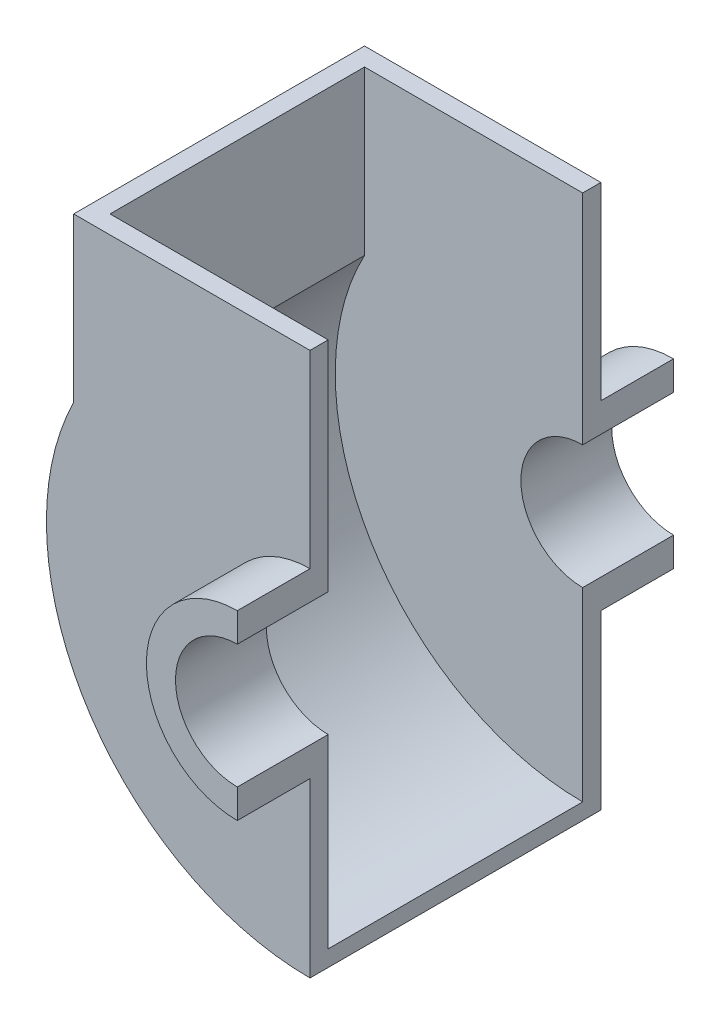
ISO-10303-21;
HEADER;
FILE_DESCRIPTION(('STEP AP214'),'2;1');
FILE_NAME('part.step','',(''),(''),'','','');
FILE_SCHEMA(('AUTOMOTIVE_DESIGN { 1 0 10303 214 1 1 1 1 }'));
ENDSEC;
DATA;
#1=APPLICATION_CONTEXT('core data for automotive mechanical design processes');
#2=APPLICATION_PROTOCOL_DEFINITION('international standard','automotive_design',2000,#1);
#3=PRODUCT_CONTEXT('',#1,'mechanical');
#4=PRODUCT('Part','Part','',(#3));
#5=PRODUCT_RELATED_PRODUCT_CATEGORY('part','',(#4));
#6=PRODUCT_DEFINITION_FORMATION('','',#4);
#7=PRODUCT_DEFINITION_CONTEXT('part definition',#1,'design');
#8=PRODUCT_DEFINITION('design','',#6,#7);
#9=PRODUCT_DEFINITION_SHAPE('','',#8);
#10=(LENGTH_UNIT() NAMED_UNIT(*) SI_UNIT(.MILLI.,.METRE.));
#11=(NAMED_UNIT(*) PLANE_ANGLE_UNIT() SI_UNIT($,.RADIAN.));
#12=(NAMED_UNIT(*) SI_UNIT($,.STERADIAN.) SOLID_ANGLE_UNIT());
#13=UNCERTAINTY_MEASURE_WITH_UNIT(LENGTH_MEASURE(1.E-05),#10,'distance_accuracy_value','');
#14=(GEOMETRIC_REPRESENTATION_CONTEXT(3) GLOBAL_UNCERTAINTY_ASSIGNED_CONTEXT((#13)) GLOBAL_UNIT_ASSIGNED_CONTEXT((#10,
#11,#12)) REPRESENTATION_CONTEXT('',''));
#15=CARTESIAN_POINT('',(0.,0.,0.));
#16=DIRECTION('',(0.,0.,1.));
#17=DIRECTION('',(1.,0.,0.));
#18=AXIS2_PLACEMENT_3D('',#15,#16,#17);
#19=CARTESIAN_POINT('',(0.,0.,-5.));
#20=DIRECTION('',(0.,0.,1.));
#21=DIRECTION('',(1.,0.,0.));
#22=AXIS2_PLACEMENT_3D('',#19,#20,#21);
#23=CYLINDRICAL_SURFACE('',#22,17.);
#24=DIRECTION('',(0.,0.,1.));
#25=VECTOR('',#24,1.);
#26=CARTESIAN_POINT('',(0.,17.,-5.));
#27=LINE('',#26,#25);
#28=CARTESIAN_POINT('',(0.,17.,-5.));
#29=VERTEX_POINT('',#28);
#30=CARTESIAN_POINT('',(0.,17.,20.));
#31=VERTEX_POINT('',#30);
#32=EDGE_CURVE('E46',#29,#31,#27,.T.);
#33=ORIENTED_EDGE('',*,*,#32,.T.);
#34=CARTESIAN_POINT('',(0.,0.,20.));
#35=DIRECTION('',(0.,0.,-1.));
#36=DIRECTION('',(1.,0.,0.));
#37=AXIS2_PLACEMENT_3D('',#34,#35,#36);
#38=CIRCLE('',#37,17.);
#39=CARTESIAN_POINT('',(0.,-17.,20.));
#40=VERTEX_POINT('',#39);
#41=EDGE_CURVE('E263',#40,#31,#38,.T.);
#42=ORIENTED_EDGE('',*,*,#41,.F.);
#43=DIRECTION('',(0.,0.,1.));
#44=VECTOR('',#43,1.);
#45=CARTESIAN_POINT('',(0.,-17.,-5.));
#46=LINE('',#45,#44);
#47=CARTESIAN_POINT('',(0.,-17.,-5.));
#48=VERTEX_POINT('',#47);
#49=EDGE_CURVE('E11',#48,#40,#46,.T.);
#50=ORIENTED_EDGE('',*,*,#49,.F.);
#51=CARTESIAN_POINT('',(0.,0.,-5.));
#52=DIRECTION('',(0.,0.,-1.));
#53=DIRECTION('',(1.,0.,0.));
#54=AXIS2_PLACEMENT_3D('',#51,#52,#53);
#55=CIRCLE('',#54,17.);
#56=EDGE_CURVE('E288',#48,#29,#55,.T.);
#57=ORIENTED_EDGE('',*,*,#56,.T.);
#58=EDGE_LOOP('',(#33,#42,#50,#57));
#59=FACE_BOUND('',#58,.T.);
#60=ADVANCED_FACE('F43',(#59),#23,.F.);
#61=CARTESIAN_POINT('',(0.,-17.,-5.));
#62=DIRECTION('',(1.,0.,0.));
#63=DIRECTION('',(0.,0.,-1.));
#64=AXIS2_PLACEMENT_3D('',#61,#62,#63);
#65=PLANE('',#64);
#66=DIRECTION('',(0.,0.,1.));
#67=VECTOR('',#66,1.);
#68=CARTESIAN_POINT('',(0.,-25.,-5.));
#69=LINE('',#68,#67);
#70=CARTESIAN_POINT('',(0.,-25.,0.));
#71=VERTEX_POINT('',#70);
#72=CARTESIAN_POINT('',(0.,-25.,20.));
#73=VERTEX_POINT('',#72);
#74=EDGE_CURVE('E52',#71,#73,#69,.T.);
#75=ORIENTED_EDGE('',*,*,#74,.F.);
#76=DIRECTION('',(0.,1.,0.));
#77=VECTOR('',#76,1.);
#78=CARTESIAN_POINT('',(0.,-25.,0.));
#79=LINE('',#78,#77);
#80=CARTESIAN_POINT('',(0.,-72.5,0.));
#81=VERTEX_POINT('',#80);
#82=EDGE_CURVE('E60',#81,#71,#79,.T.);
#83=ORIENTED_EDGE('',*,*,#82,.F.);
#84=DIRECTION('',(0.,0.,1.));
#85=VECTOR('',#84,1.);
#86=CARTESIAN_POINT('',(0.,-72.5,-5.));
#87=LINE('',#86,#85);
#88=CARTESIAN_POINT('',(0.,-72.5,-80.));
#89=VERTEX_POINT('',#88);
#90=EDGE_CURVE('E260',#89,#81,#87,.T.);
#91=ORIENTED_EDGE('',*,*,#90,.F.);
#92=DIRECTION('',(0.,1.,0.));
#93=VECTOR('',#92,1.);
#94=CARTESIAN_POINT('',(0.,-25.,-80.));
#95=LINE('',#94,#93);
#96=CARTESIAN_POINT('',(0.,-25.,-80.));
#97=VERTEX_POINT('',#96);
#98=EDGE_CURVE('E171',#89,#97,#95,.T.);
#99=ORIENTED_EDGE('',*,*,#98,.T.);
#100=DIRECTION('',(0.,0.,-1.));
#101=VECTOR('',#100,1.);
#102=CARTESIAN_POINT('',(0.,-25.,-75.));
#103=LINE('',#102,#101);
#104=CARTESIAN_POINT('',(0.,-25.,-100.));
#105=VERTEX_POINT('',#104);
#106=EDGE_CURVE('E203',#97,#105,#103,.T.);
#107=ORIENTED_EDGE('',*,*,#106,.T.);
#108=DIRECTION('',(0.,1.,0.));
#109=VECTOR('',#108,1.);
#110=CARTESIAN_POINT('',(0.,-17.,-100.));
#111=LINE('',#110,#109);
#112=CARTESIAN_POINT('',(0.,-17.,-100.));
#113=VERTEX_POINT('',#112);
#114=EDGE_CURVE('E194',#105,#113,#111,.T.);
#115=ORIENTED_EDGE('',*,*,#114,.T.);
#116=DIRECTION('',(0.,0.,-1.));
#117=VECTOR('',#116,1.);
#118=CARTESIAN_POINT('',(0.,-17.,-75.));
#119=LINE('',#118,#117);
#120=CARTESIAN_POINT('',(0.,-17.,-75.));
#121=VERTEX_POINT('',#120);
#122=EDGE_CURVE('E198',#121,#113,#119,.T.);
#123=ORIENTED_EDGE('',*,*,#122,.F.);
#124=DIRECTION('',(0.,1.,0.));
#125=VECTOR('',#124,1.);
#126=CARTESIAN_POINT('',(0.,-17.,-75.));
#127=LINE('',#126,#125);
#128=CARTESIAN_POINT('',(0.,-68.053287944081,-75.));
#129=VERTEX_POINT('',#128);
#130=EDGE_CURVE('E188',#129,#121,#127,.T.);
#131=ORIENTED_EDGE('',*,*,#130,.F.);
#132=DIRECTION('',(0.,0.,1.));
#133=VECTOR('',#132,1.);
#134=CARTESIAN_POINT('',(0.,-68.053287944081,-241.152038807834));
#135=LINE('',#134,#133);
#136=CARTESIAN_POINT('',(0.,-68.053287944081,-5.00000000000006));
#137=VERTEX_POINT('',#136);
#138=EDGE_CURVE('E202',#129,#137,#135,.T.);
#139=ORIENTED_EDGE('',*,*,#138,.T.);
#140=DIRECTION('',(0.,1.,0.));
#141=VECTOR('',#140,1.);
#142=CARTESIAN_POINT('',(0.,-17.,-5.));
#143=LINE('',#142,#141);
#144=EDGE_CURVE('E295',#137,#48,#143,.T.);
#145=ORIENTED_EDGE('',*,*,#144,.T.);
#146=ORIENTED_EDGE('',*,*,#49,.T.);
#147=DIRECTION('',(0.,1.,0.));
#148=VECTOR('',#147,1.);
#149=CARTESIAN_POINT('',(0.,-17.,20.));
#150=LINE('',#149,#148);
#151=EDGE_CURVE('E284',#73,#40,#150,.T.);
#152=ORIENTED_EDGE('',*,*,#151,.F.);
#153=EDGE_LOOP('',(#75,#83,#91,#99,#107,#115,#123,#131,#139,#145,#146,#152));
#154=FACE_BOUND('',#153,.T.);
#155=ADVANCED_FACE('F314',(#154),#65,.T.);
#156=CARTESIAN_POINT('',(0.,0.,-5.));
#157=DIRECTION('',(0.,0.,1.));
#158=DIRECTION('',(1.,0.,0.));
#159=AXIS2_PLACEMENT_3D('',#156,#157,#158);
#160=CYLINDRICAL_SURFACE('',#159,25.);
#161=CARTESIAN_POINT('',(0.,0.,0.));
#162=DIRECTION('',(0.,0.,-1.));
#163=DIRECTION('',(1.,0.,0.));
#164=AXIS2_PLACEMENT_3D('',#161,#162,#163);
#165=CIRCLE('',#164,25.);
#166=CARTESIAN_POINT('',(0.,25.,0.));
#167=VERTEX_POINT('',#166);
#168=EDGE_CURVE('E237',#71,#167,#165,.T.);
#169=ORIENTED_EDGE('',*,*,#168,.F.);
#170=ORIENTED_EDGE('',*,*,#74,.T.);
#171=CARTESIAN_POINT('',(0.,0.,20.));
#172=DIRECTION('',(0.,0.,1.));
#173=DIRECTION('',(1.,0.,0.));
#174=AXIS2_PLACEMENT_3D('',#171,#172,#173);
#175=CIRCLE('',#174,25.);
#176=CARTESIAN_POINT('',(0.,25.,20.));
#177=VERTEX_POINT('',#176);
#178=EDGE_CURVE('E280',#177,#73,#175,.T.);
#179=ORIENTED_EDGE('',*,*,#178,.F.);
#180=DIRECTION('',(0.,0.,1.));
#181=VECTOR('',#180,1.);
#182=CARTESIAN_POINT('',(0.,25.,-5.));
#183=LINE('',#182,#181);
#184=EDGE_CURVE('E67',#167,#177,#183,.T.);
#185=ORIENTED_EDGE('',*,*,#184,.F.);
#186=EDGE_LOOP('',(#169,#170,#179,#185));
#187=FACE_BOUND('',#186,.T.);
#188=ADVANCED_FACE('F323',(#187),#160,.T.);
#189=CARTESIAN_POINT('',(0.,25.,-5.));
#190=DIRECTION('',(1.,0.,0.));
#191=DIRECTION('',(0.,0.,-1.));
#192=AXIS2_PLACEMENT_3D('',#189,#190,#191);
#193=PLANE('',#192);
#194=DIRECTION('',(0.,1.,0.));
#195=VECTOR('',#194,1.);
#196=CARTESIAN_POINT('',(0.,25.,-5.));
#197=LINE('',#196,#195);
#198=CARTESIAN_POINT('',(0.,77.,-5.));
#199=VERTEX_POINT('',#198);
#200=EDGE_CURVE('E292',#29,#199,#197,.T.);
#201=ORIENTED_EDGE('',*,*,#200,.T.);
#202=DIRECTION('',(0.,0.,1.));
#203=VECTOR('',#202,1.);
#204=CARTESIAN_POINT('',(0.,77.,-5.));
#205=LINE('',#204,#203);
#206=CARTESIAN_POINT('',(0.,77.,0.));
#207=VERTEX_POINT('',#206);
#208=EDGE_CURVE('E241',#199,#207,#205,.T.);
#209=ORIENTED_EDGE('',*,*,#208,.T.);
#210=DIRECTION('',(0.,1.,0.));
#211=VECTOR('',#210,1.);
#212=CARTESIAN_POINT('',(0.,25.,0.));
#213=LINE('',#212,#211);
#214=EDGE_CURVE('E244',#167,#207,#213,.T.);
#215=ORIENTED_EDGE('',*,*,#214,.F.);
#216=ORIENTED_EDGE('',*,*,#184,.T.);
#217=DIRECTION('',(0.,1.,0.));
#218=VECTOR('',#217,1.);
#219=CARTESIAN_POINT('',(0.,25.,20.));
#220=LINE('',#219,#218);
#221=EDGE_CURVE('E276',#31,#177,#220,.T.);
#222=ORIENTED_EDGE('',*,*,#221,.F.);
#223=ORIENTED_EDGE('',*,*,#32,.F.);
#224=EDGE_LOOP('',(#201,#209,#215,#216,#222,#223));
#225=FACE_BOUND('',#224,.T.);
#226=ADVANCED_FACE('F308',(#225),#193,.T.);
#227=CARTESIAN_POINT('',(0.,0.,-5.));
#228=DIRECTION('',(0.,0.,1.));
#229=DIRECTION('',(1.,0.,0.));
#230=AXIS2_PLACEMENT_3D('',#227,#228,#229);
#231=PLANE('',#230);
#232=ORIENTED_EDGE('',*,*,#144,.F.);
#233=CARTESIAN_POINT('',(0.,0.,-5.));
#234=DIRECTION('',(0.,0.,1.));
#235=DIRECTION('',(1.,0.,0.));
#236=AXIS2_PLACEMENT_3D('',#233,#234,#235);
#237=CIRCLE('',#236,68.053287944081);
#238=CARTESIAN_POINT('',(-60.,32.1130814466629,-5.00000000000006));
#239=VERTEX_POINT('',#238);
#240=EDGE_CURVE('E233',#137,#239,#237,.F.);
#241=ORIENTED_EDGE('',*,*,#240,.T.);
#242=DIRECTION('',(0.,1.,0.));
#243=VECTOR('',#242,1.);
#244=CARTESIAN_POINT('',(-60.,0.,-5.));
#245=LINE('',#244,#243);
#246=CARTESIAN_POINT('',(-60.,77.,-5.00000000000006));
#247=VERTEX_POINT('',#246);
#248=EDGE_CURVE('E223',#239,#247,#245,.T.);
#249=ORIENTED_EDGE('',*,*,#248,.T.);
#250=DIRECTION('',(-1.,0.,0.));
#251=VECTOR('',#250,1.);
#252=CARTESIAN_POINT('',(0.,77.,-5.));
#253=LINE('',#252,#251);
#254=EDGE_CURVE('E238',#199,#247,#253,.T.);
#255=ORIENTED_EDGE('',*,*,#254,.F.);
#256=ORIENTED_EDGE('',*,*,#200,.F.);
#257=ORIENTED_EDGE('',*,*,#56,.F.);
#258=EDGE_LOOP('',(#232,#241,#249,#255,#256,#257));
#259=FACE_BOUND('',#258,.T.);
#260=ADVANCED_FACE('F317',(#259),#231,.F.);
#261=CARTESIAN_POINT('',(0.,0.,20.));
#262=DIRECTION('',(0.,0.,1.));
#263=DIRECTION('',(1.,0.,0.));
#264=AXIS2_PLACEMENT_3D('',#261,#262,#263);
#265=PLANE('',#264);
#266=ORIENTED_EDGE('',*,*,#41,.T.);
#267=ORIENTED_EDGE('',*,*,#221,.T.);
#268=ORIENTED_EDGE('',*,*,#178,.T.);
#269=ORIENTED_EDGE('',*,*,#151,.T.);
#270=EDGE_LOOP('',(#266,#267,#268,#269));
#271=FACE_BOUND('',#270,.T.);
#272=ADVANCED_FACE('F310',(#271),#265,.T.);
#273=CARTESIAN_POINT('',(0.,0.,-5.));
#274=DIRECTION('',(0.,0.,1.));
#275=DIRECTION('',(1.,0.,0.));
#276=AXIS2_PLACEMENT_3D('',#273,#274,#275);
#277=CYLINDRICAL_SURFACE('',#276,72.5);
#278=CARTESIAN_POINT('',(0.,0.,0.));
#279=DIRECTION('',(0.,0.,1.));
#280=DIRECTION('',(1.,0.,0.));
#281=AXIS2_PLACEMENT_3D('',#278,#279,#280);
#282=CIRCLE('',#281,72.5);
#283=CARTESIAN_POINT('',(-65.,32.1130814466629,0.));
#284=VERTEX_POINT('',#283);
#285=EDGE_CURVE('E255',#284,#81,#282,.T.);
#286=ORIENTED_EDGE('',*,*,#285,.F.);
#287=DIRECTION('',(0.,0.,1.));
#288=VECTOR('',#287,1.);
#289=CARTESIAN_POINT('',(-65.,32.1130814466629,-5.));
#290=LINE('',#289,#288);
#291=CARTESIAN_POINT('',(-65.,32.1130814466629,-80.));
#292=VERTEX_POINT('',#291);
#293=EDGE_CURVE('E264',#292,#284,#290,.T.);
#294=ORIENTED_EDGE('',*,*,#293,.F.);
#295=CARTESIAN_POINT('',(0.,0.,-80.));
#296=DIRECTION('',(0.,0.,1.));
#297=DIRECTION('',(1.,0.,0.));
#298=AXIS2_PLACEMENT_3D('',#295,#296,#297);
#299=CIRCLE('',#298,72.5);
#300=EDGE_CURVE('E573',#292,#89,#299,.T.);
#301=ORIENTED_EDGE('',*,*,#300,.T.);
#302=ORIENTED_EDGE('',*,*,#90,.T.);
#303=EDGE_LOOP('',(#286,#294,#301,#302));
#304=FACE_BOUND('',#303,.T.);
#305=ADVANCED_FACE('F344',(#304),#277,.T.);
#306=CARTESIAN_POINT('',(-65.,77.,-5.));
#307=DIRECTION('',(-1.,0.,0.));
#308=DIRECTION('',(0.,-1.,0.));
#309=AXIS2_PLACEMENT_3D('',#306,#307,#308);
#310=PLANE('',#309);
#311=DIRECTION('',(0.,-1.,0.));
#312=VECTOR('',#311,1.);
#313=CARTESIAN_POINT('',(-65.,77.,0.));
#314=LINE('',#313,#312);
#315=CARTESIAN_POINT('',(-65.,77.,0.));
#316=VERTEX_POINT('',#315);
#317=EDGE_CURVE('E251',#316,#284,#314,.T.);
#318=ORIENTED_EDGE('',*,*,#317,.F.);
#319=DIRECTION('',(0.,0.,1.));
#320=VECTOR('',#319,1.);
#321=CARTESIAN_POINT('',(-65.,77.,-5.));
#322=LINE('',#321,#320);
#323=CARTESIAN_POINT('',(-65.,77.,-80.));
#324=VERTEX_POINT('',#323);
#325=EDGE_CURVE('E267',#324,#316,#322,.T.);
#326=ORIENTED_EDGE('',*,*,#325,.F.);
#327=DIRECTION('',(0.,-1.,0.));
#328=VECTOR('',#327,1.);
#329=CARTESIAN_POINT('',(-65.,77.,-80.));
#330=LINE('',#329,#328);
#331=EDGE_CURVE('E576',#324,#292,#330,.T.);
#332=ORIENTED_EDGE('',*,*,#331,.T.);
#333=ORIENTED_EDGE('',*,*,#293,.T.);
#334=EDGE_LOOP('',(#318,#326,#332,#333));
#335=FACE_BOUND('',#334,.T.);
#336=ADVANCED_FACE('F385',(#335),#310,.T.);
#337=CARTESIAN_POINT('',(0.,77.,-5.));
#338=DIRECTION('',(0.,1.,0.));
#339=DIRECTION('',(-1.,0.,0.));
#340=AXIS2_PLACEMENT_3D('',#337,#338,#339);
#341=PLANE('',#340);
#342=ORIENTED_EDGE('',*,*,#254,.T.);
#343=DIRECTION('',(0.,0.,1.));
#344=VECTOR('',#343,1.);
#345=CARTESIAN_POINT('',(-60.,77.,-241.152038807834));
#346=LINE('',#345,#344);
#347=CARTESIAN_POINT('',(-60.,77.,-75.));
#348=VERTEX_POINT('',#347);
#349=EDGE_CURVE('E166',#348,#247,#346,.T.);
#350=ORIENTED_EDGE('',*,*,#349,.F.);
#351=DIRECTION('',(-1.,0.,0.));
#352=VECTOR('',#351,1.);
#353=CARTESIAN_POINT('',(0.,77.,-75.));
#354=LINE('',#353,#352);
#355=CARTESIAN_POINT('',(0.,77.,-75.));
#356=VERTEX_POINT('',#355);
#357=EDGE_CURVE('E159',#356,#348,#354,.T.);
#358=ORIENTED_EDGE('',*,*,#357,.F.);
#359=DIRECTION('',(0.,0.,-1.));
#360=VECTOR('',#359,1.);
#361=CARTESIAN_POINT('',(0.,77.,-75.));
#362=LINE('',#361,#360);
#363=CARTESIAN_POINT('',(0.,77.,-80.));
#364=VERTEX_POINT('',#363);
#365=EDGE_CURVE('E164',#356,#364,#362,.T.);
#366=ORIENTED_EDGE('',*,*,#365,.T.);
#367=DIRECTION('',(-1.,0.,0.));
#368=VECTOR('',#367,1.);
#369=CARTESIAN_POINT('',(0.,77.,-80.));
#370=LINE('',#369,#368);
#371=EDGE_CURVE('E596',#364,#324,#370,.T.);
#372=ORIENTED_EDGE('',*,*,#371,.T.);
#373=ORIENTED_EDGE('',*,*,#325,.T.);
#374=DIRECTION('',(-1.,0.,0.));
#375=VECTOR('',#374,1.);
#376=CARTESIAN_POINT('',(0.,77.,0.));
#377=LINE('',#376,#375);
#378=EDGE_CURVE('E248',#207,#316,#377,.T.);
#379=ORIENTED_EDGE('',*,*,#378,.F.);
#380=ORIENTED_EDGE('',*,*,#208,.F.);
#381=EDGE_LOOP('',(#342,#350,#358,#366,#372,#373,#379,#380));
#382=FACE_BOUND('',#381,.T.);
#383=ADVANCED_FACE('F162',(#382),#341,.T.);
#384=CARTESIAN_POINT('',(0.,0.,0.));
#385=DIRECTION('',(0.,0.,1.));
#386=DIRECTION('',(1.,0.,0.));
#387=AXIS2_PLACEMENT_3D('',#384,#385,#386);
#388=PLANE('',#387);
#389=ORIENTED_EDGE('',*,*,#82,.T.);
#390=ORIENTED_EDGE('',*,*,#168,.T.);
#391=ORIENTED_EDGE('',*,*,#214,.T.);
#392=ORIENTED_EDGE('',*,*,#378,.T.);
#393=ORIENTED_EDGE('',*,*,#317,.T.);
#394=ORIENTED_EDGE('',*,*,#285,.T.);
#395=EDGE_LOOP('',(#389,#390,#391,#392,#393,#394));
#396=FACE_BOUND('',#395,.T.);
#397=ADVANCED_FACE('F322',(#396),#388,.T.);
#398=CARTESIAN_POINT('',(0.,0.,-241.152038807834));
#399=DIRECTION('',(0.,0.,1.));
#400=DIRECTION('',(1.,0.,0.));
#401=AXIS2_PLACEMENT_3D('',#398,#399,#400);
#402=CYLINDRICAL_SURFACE('',#401,68.053287944081);
#403=ORIENTED_EDGE('',*,*,#240,.F.);
#404=ORIENTED_EDGE('',*,*,#138,.F.);
#405=CARTESIAN_POINT('',(0.,0.,-75.));
#406=DIRECTION('',(0.,0.,-1.));
#407=DIRECTION('',(-1.,0.,0.));
#408=AXIS2_PLACEMENT_3D('',#405,#406,#407);
#409=CIRCLE('',#408,68.053287944081);
#410=CARTESIAN_POINT('',(-60.,32.1130814466629,-75.));
#411=VERTEX_POINT('',#410);
#412=EDGE_CURVE('E217',#129,#411,#409,.T.);
#413=ORIENTED_EDGE('',*,*,#412,.T.);
#414=DIRECTION('',(0.,0.,1.));
#415=VECTOR('',#414,1.);
#416=CARTESIAN_POINT('',(-60.,32.1130814466629,-241.152038807834));
#417=LINE('',#416,#415);
#418=EDGE_CURVE('E216',#411,#239,#417,.T.);
#419=ORIENTED_EDGE('',*,*,#418,.T.);
#420=EDGE_LOOP('',(#403,#404,#413,#419));
#421=FACE_BOUND('',#420,.T.);
#422=ADVANCED_FACE('F414',(#421),#402,.F.);
#423=CARTESIAN_POINT('',(-60.,77.,-241.152038807834));
#424=DIRECTION('',(1.,0.,0.));
#425=DIRECTION('',(0.,1.,0.));
#426=AXIS2_PLACEMENT_3D('',#423,#424,#425);
#427=PLANE('',#426);
#428=ORIENTED_EDGE('',*,*,#248,.F.);
#429=ORIENTED_EDGE('',*,*,#418,.F.);
#430=DIRECTION('',(0.,1.,0.));
#431=VECTOR('',#430,1.);
#432=CARTESIAN_POINT('',(-60.,77.,-75.));
#433=LINE('',#432,#431);
#434=EDGE_CURVE('E213',#411,#348,#433,.T.);
#435=ORIENTED_EDGE('',*,*,#434,.T.);
#436=ORIENTED_EDGE('',*,*,#349,.T.);
#437=EDGE_LOOP('',(#428,#429,#435,#436));
#438=FACE_BOUND('',#437,.T.);
#439=ADVANCED_FACE('F421',(#438),#427,.T.);
#440=CARTESIAN_POINT('',(0.,0.,-75.));
#441=DIRECTION('',(0.,0.,-1.));
#442=DIRECTION('',(1.,0.,0.));
#443=AXIS2_PLACEMENT_3D('',#440,#441,#442);
#444=PLANE('',#443);
#445=ORIENTED_EDGE('',*,*,#434,.F.);
#446=ORIENTED_EDGE('',*,*,#412,.F.);
#447=ORIENTED_EDGE('',*,*,#130,.T.);
#448=CARTESIAN_POINT('',(0.,0.,-75.));
#449=DIRECTION('',(0.,0.,-1.));
#450=DIRECTION('',(1.,0.,0.));
#451=AXIS2_PLACEMENT_3D('',#448,#449,#450);
#452=CIRCLE('',#451,17.);
#453=CARTESIAN_POINT('',(0.,17.,-75.));
#454=VERTEX_POINT('',#453);
#455=EDGE_CURVE('E185',#121,#454,#452,.T.);
#456=ORIENTED_EDGE('',*,*,#455,.T.);
#457=DIRECTION('',(0.,1.,0.));
#458=VECTOR('',#457,1.);
#459=CARTESIAN_POINT('',(0.,25.,-75.));
#460=LINE('',#459,#458);
#461=EDGE_CURVE('E176',#454,#356,#460,.T.);
#462=ORIENTED_EDGE('',*,*,#461,.T.);
#463=ORIENTED_EDGE('',*,*,#357,.T.);
#464=EDGE_LOOP('',(#445,#446,#447,#456,#462,#463));
#465=FACE_BOUND('',#464,.T.);
#466=ADVANCED_FACE('F183',(#465),#444,.F.);
#467=CARTESIAN_POINT('',(0.,0.,-75.));
#468=DIRECTION('',(0.,0.,-1.));
#469=DIRECTION('',(1.,0.,0.));
#470=AXIS2_PLACEMENT_3D('',#467,#468,#469);
#471=CYLINDRICAL_SURFACE('',#470,17.);
#472=DIRECTION('',(0.,0.,-1.));
#473=VECTOR('',#472,1.);
#474=CARTESIAN_POINT('',(0.,17.,-75.));
#475=LINE('',#474,#473);
#476=CARTESIAN_POINT('',(0.,17.,-100.));
#477=VERTEX_POINT('',#476);
#478=EDGE_CURVE('E192',#454,#477,#475,.T.);
#479=ORIENTED_EDGE('',*,*,#478,.F.);
#480=ORIENTED_EDGE('',*,*,#455,.F.);
#481=ORIENTED_EDGE('',*,*,#122,.T.);
#482=CARTESIAN_POINT('',(0.,0.,-100.));
#483=DIRECTION('',(0.,0.,-1.));
#484=DIRECTION('',(1.,0.,0.));
#485=AXIS2_PLACEMENT_3D('',#482,#483,#484);
#486=CIRCLE('',#485,17.);
#487=EDGE_CURVE('E181',#113,#477,#486,.T.);
#488=ORIENTED_EDGE('',*,*,#487,.T.);
#489=EDGE_LOOP('',(#479,#480,#481,#488));
#490=FACE_BOUND('',#489,.T.);
#491=ADVANCED_FACE('F440',(#490),#471,.F.);
#492=CARTESIAN_POINT('',(0.,0.,-75.));
#493=DIRECTION('',(0.,0.,-1.));
#494=DIRECTION('',(1.,0.,0.));
#495=AXIS2_PLACEMENT_3D('',#492,#493,#494);
#496=CYLINDRICAL_SURFACE('',#495,25.);
#497=CARTESIAN_POINT('',(0.,0.,-80.));
#498=DIRECTION('',(0.,0.,-1.));
#499=DIRECTION('',(1.,0.,0.));
#500=AXIS2_PLACEMENT_3D('',#497,#498,#499);
#501=CIRCLE('',#500,25.);
#502=CARTESIAN_POINT('',(0.,25.,-80.));
#503=VERTEX_POINT('',#502);
#504=EDGE_CURVE('E562',#97,#503,#501,.T.);
#505=ORIENTED_EDGE('',*,*,#504,.T.);
#506=DIRECTION('',(0.,0.,-1.));
#507=VECTOR('',#506,1.);
#508=CARTESIAN_POINT('',(0.,25.,-75.));
#509=LINE('',#508,#507);
#510=CARTESIAN_POINT('',(0.,25.,-100.));
#511=VERTEX_POINT('',#510);
#512=EDGE_CURVE('E207',#503,#511,#509,.T.);
#513=ORIENTED_EDGE('',*,*,#512,.T.);
#514=CARTESIAN_POINT('',(0.,0.,-100.));
#515=DIRECTION('',(0.,0.,1.));
#516=DIRECTION('',(1.,0.,0.));
#517=AXIS2_PLACEMENT_3D('',#514,#515,#516);
#518=CIRCLE('',#517,25.);
#519=EDGE_CURVE('E569',#511,#105,#518,.T.);
#520=ORIENTED_EDGE('',*,*,#519,.T.);
#521=ORIENTED_EDGE('',*,*,#106,.F.);
#522=EDGE_LOOP('',(#505,#513,#520,#521));
#523=FACE_BOUND('',#522,.T.);
#524=ADVANCED_FACE('F448',(#523),#496,.T.);
#525=CARTESIAN_POINT('',(0.,25.,-75.));
#526=DIRECTION('',(1.,0.,0.));
#527=DIRECTION('',(0.,0.,1.));
#528=AXIS2_PLACEMENT_3D('',#525,#526,#527);
#529=PLANE('',#528);
#530=ORIENTED_EDGE('',*,*,#461,.F.);
#531=ORIENTED_EDGE('',*,*,#478,.T.);
#532=DIRECTION('',(0.,1.,0.));
#533=VECTOR('',#532,1.);
#534=CARTESIAN_POINT('',(0.,25.,-100.));
#535=LINE('',#534,#533);
#536=EDGE_CURVE('E583',#477,#511,#535,.T.);
#537=ORIENTED_EDGE('',*,*,#536,.T.);
#538=ORIENTED_EDGE('',*,*,#512,.F.);
#539=DIRECTION('',(0.,1.,0.));
#540=VECTOR('',#539,1.);
#541=CARTESIAN_POINT('',(0.,25.,-80.));
#542=LINE('',#541,#540);
#543=EDGE_CURVE('E179',#503,#364,#542,.T.);
#544=ORIENTED_EDGE('',*,*,#543,.T.);
#545=ORIENTED_EDGE('',*,*,#365,.F.);
#546=EDGE_LOOP('',(#530,#531,#537,#538,#544,#545));
#547=FACE_BOUND('',#546,.T.);
#548=ADVANCED_FACE('F174',(#547),#529,.T.);
#549=CARTESIAN_POINT('',(0.,0.,-100.));
#550=DIRECTION('',(0.,0.,-1.));
#551=DIRECTION('',(1.,0.,0.));
#552=AXIS2_PLACEMENT_3D('',#549,#550,#551);
#553=PLANE('',#552);
#554=ORIENTED_EDGE('',*,*,#487,.F.);
#555=ORIENTED_EDGE('',*,*,#114,.F.);
#556=ORIENTED_EDGE('',*,*,#519,.F.);
#557=ORIENTED_EDGE('',*,*,#536,.F.);
#558=EDGE_LOOP('',(#554,#555,#556,#557));
#559=FACE_BOUND('',#558,.T.);
#560=ADVANCED_FACE('F464',(#559),#553,.T.);
#561=CARTESIAN_POINT('',(0.,0.,-80.));
#562=DIRECTION('',(0.,0.,-1.));
#563=DIRECTION('',(1.,0.,0.));
#564=AXIS2_PLACEMENT_3D('',#561,#562,#563);
#565=PLANE('',#564);
#566=ORIENTED_EDGE('',*,*,#504,.F.);
#567=ORIENTED_EDGE('',*,*,#98,.F.);
#568=ORIENTED_EDGE('',*,*,#300,.F.);
#569=ORIENTED_EDGE('',*,*,#331,.F.);
#570=ORIENTED_EDGE('',*,*,#371,.F.);
#571=ORIENTED_EDGE('',*,*,#543,.F.);
#572=EDGE_LOOP('',(#566,#567,#568,#569,#570,#571));
#573=FACE_BOUND('',#572,.T.);
#574=ADVANCED_FACE('F471',(#573),#565,.T.);
#575=CLOSED_SHELL('',(#60,#155,#188,#226,#260,#272,#305,#336,#383,#397,#422,#439,#466,#491,#524,
#548,#560,#574));
#576=MANIFOLD_SOLID_BREP('B2',#575);
#577=ADVANCED_BREP_SHAPE_REPRESENTATION('',(#18,#576),#14);
#578=SHAPE_DEFINITION_REPRESENTATION(#9,#577);
ENDSEC;
END-ISO-10303-21;
